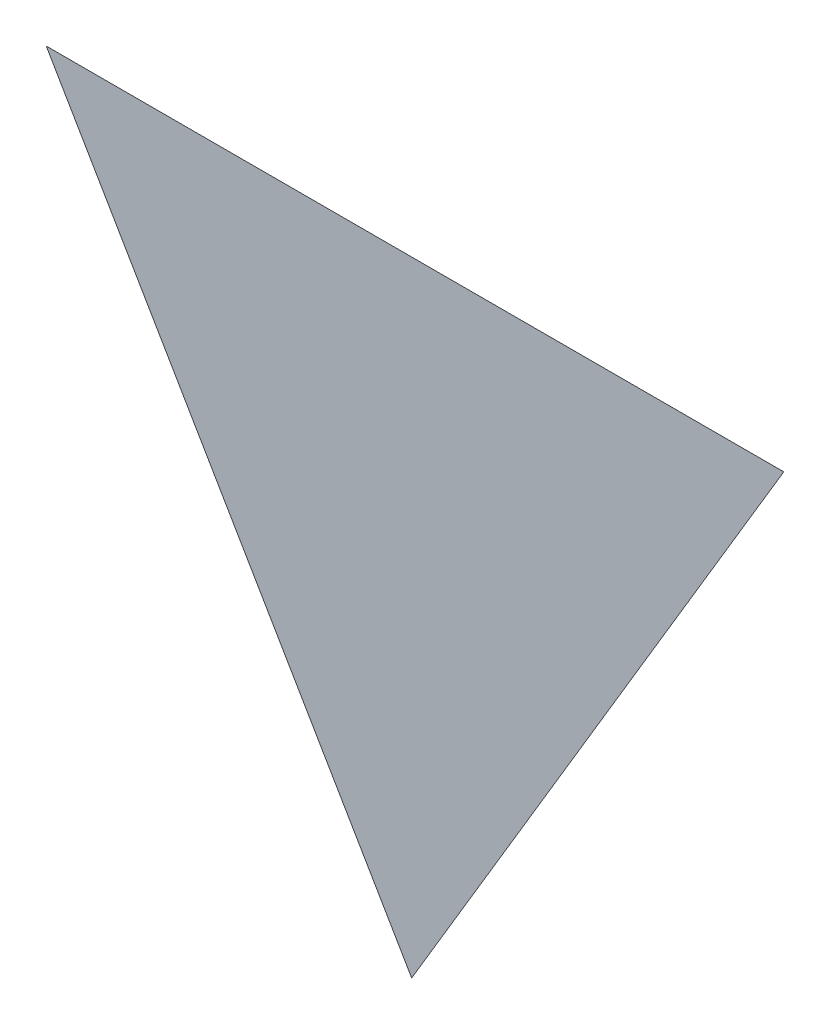
ISO-10303-21;
HEADER;
FILE_DESCRIPTION(('STEP AP214'),'2;1');
FILE_NAME('part.step','',(''),(''),'','','');
FILE_SCHEMA(('AUTOMOTIVE_DESIGN { 1 0 10303 214 1 1 1 1 }'));
ENDSEC;
DATA;
#1=APPLICATION_CONTEXT('core data for automotive mechanical design processes');
#2=APPLICATION_PROTOCOL_DEFINITION('international standard','automotive_design',2000,#1);
#3=PRODUCT_CONTEXT('',#1,'mechanical');
#4=PRODUCT('Part','Part','',(#3));
#5=PRODUCT_RELATED_PRODUCT_CATEGORY('part','',(#4));
#6=PRODUCT_DEFINITION_FORMATION('','',#4);
#7=PRODUCT_DEFINITION_CONTEXT('part definition',#1,'design');
#8=PRODUCT_DEFINITION('design','',#6,#7);
#9=PRODUCT_DEFINITION_SHAPE('','',#8);
#10=(LENGTH_UNIT() NAMED_UNIT(*) SI_UNIT(.MILLI.,.METRE.));
#11=(NAMED_UNIT(*) PLANE_ANGLE_UNIT() SI_UNIT($,.RADIAN.));
#12=(NAMED_UNIT(*) SI_UNIT($,.STERADIAN.) SOLID_ANGLE_UNIT());
#13=UNCERTAINTY_MEASURE_WITH_UNIT(LENGTH_MEASURE(1.E-05),#10,'distance_accuracy_value','');
#14=(GEOMETRIC_REPRESENTATION_CONTEXT(3) GLOBAL_UNCERTAINTY_ASSIGNED_CONTEXT((#13)) GLOBAL_UNIT_ASSIGNED_CONTEXT((#10,
#11,#12)) REPRESENTATION_CONTEXT('',''));
#15=CARTESIAN_POINT('',(0.,0.,0.));
#16=DIRECTION('',(0.,0.,1.));
#17=DIRECTION('',(1.,0.,0.));
#18=AXIS2_PLACEMENT_3D('',#15,#16,#17);
#19=CARTESIAN_POINT('',(-0.04544922274898,0.591055919997,0.00045));
#20=DIRECTION('',(0.,0.,1.));
#21=DIRECTION('',(1.,0.,0.));
#22=AXIS2_PLACEMENT_3D('',#19,#20,#21);
#23=PLANE('',#22);
#24=CARTESIAN_POINT('',(0.05544346980105,0.761886777217,0.00045));
#25=DIRECTION('',(-1.,0.,0.));
#26=VECTOR('',#25,1.);
#27=LINE('',#24,#26);
#28=CARTESIAN_POINT('',(0.05544346980105,0.761886777217,0.000225));
#29=VERTEX_POINT('',#28);
#30=CARTESIAN_POINT('',(-0.146341915299,0.761886777217,0.000225));
#31=VERTEX_POINT('',#30);
#32=EDGE_CURVE('E39',#29,#31,#27,.T.);
#33=ORIENTED_EDGE('',*,*,#32,.T.);
#34=CARTESIAN_POINT('',(-0.146341915299,0.761886777217,0.00045));
#35=DIRECTION('',(0.505103546373026,-0.863058750863111,0.));
#36=VECTOR('',#35,1.);
#37=LINE('',#34,#36);
#38=CARTESIAN_POINT('',(-0.04636347034902,0.591055919997,0.000225));
#39=VERTEX_POINT('',#38);
#40=EDGE_CURVE('E28',#31,#39,#37,.T.);
#41=ORIENTED_EDGE('',*,*,#40,.T.);
#42=CARTESIAN_POINT('',(-0.04636347034902,0.591055919997,0.00045));
#43=DIRECTION('',(0.511936422084376,0.85902334062786,0.));
#44=VECTOR('',#43,1.);
#45=LINE('',#42,#44);
#46=EDGE_CURVE('E11',#39,#29,#45,.T.);
#47=ORIENTED_EDGE('',*,*,#46,.T.);
#48=EDGE_LOOP('',(#33,#41,#47));
#49=FACE_BOUND('',#48,.T.);
#50=ADVANCED_FACE('F17',(#49),#23,.T.);
#51=CARTESIAN_POINT('',(-0.04544922274898,0.591055919997,0.));
#52=DIRECTION('',(0.,0.,1.));
#53=DIRECTION('',(1.,0.,0.));
#54=AXIS2_PLACEMENT_3D('',#51,#52,#53);
#55=PLANE('',#54);
#56=ORIENTED_EDGE('',*,*,#40,.F.);
#57=ORIENTED_EDGE('',*,*,#32,.F.);
#58=ORIENTED_EDGE('',*,*,#46,.F.);
#59=EDGE_LOOP('',(#56,#57,#58));
#60=FACE_BOUND('',#59,.T.);
#61=ADVANCED_FACE('F41',(#60),#55,.F.);
#62=CLOSED_SHELL('',(#50,#61));
#63=MANIFOLD_SOLID_BREP('B1',#62);
#64=ADVANCED_BREP_SHAPE_REPRESENTATION('',(#18,#63),#14);
#65=SHAPE_DEFINITION_REPRESENTATION(#9,#64);
ENDSEC;
END-ISO-10303-21;
